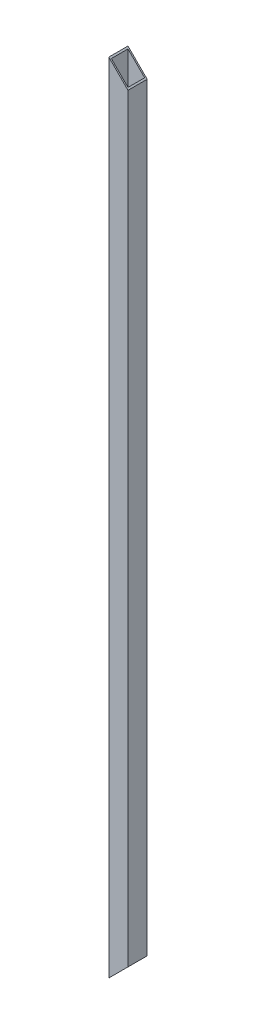
ISO-10303-21;
HEADER;
FILE_DESCRIPTION(('STEP AP214'),'2;1');
FILE_NAME('part.step','',(''),(''),'','','');
FILE_SCHEMA(('AUTOMOTIVE_DESIGN { 1 0 10303 214 1 1 1 1 }'));
ENDSEC;
DATA;
#1=APPLICATION_CONTEXT('core data for automotive mechanical design processes');
#2=APPLICATION_PROTOCOL_DEFINITION('international standard','automotive_design',2000,#1);
#3=PRODUCT_CONTEXT('',#1,'mechanical');
#4=PRODUCT('Part','Part','',(#3));
#5=PRODUCT_RELATED_PRODUCT_CATEGORY('part','',(#4));
#6=PRODUCT_DEFINITION_FORMATION('','',#4);
#7=PRODUCT_DEFINITION_CONTEXT('part definition',#1,'design');
#8=PRODUCT_DEFINITION('design','',#6,#7);
#9=PRODUCT_DEFINITION_SHAPE('','',#8);
#10=(LENGTH_UNIT() NAMED_UNIT(*) SI_UNIT(.MILLI.,.METRE.));
#11=(NAMED_UNIT(*) PLANE_ANGLE_UNIT() SI_UNIT($,.RADIAN.));
#12=(NAMED_UNIT(*) SI_UNIT($,.STERADIAN.) SOLID_ANGLE_UNIT());
#13=UNCERTAINTY_MEASURE_WITH_UNIT(LENGTH_MEASURE(1.E-05),#10,'distance_accuracy_value','');
#14=(GEOMETRIC_REPRESENTATION_CONTEXT(3) GLOBAL_UNCERTAINTY_ASSIGNED_CONTEXT((#13)) GLOBAL_UNIT_ASSIGNED_CONTEXT((#10,
#11,#12)) REPRESENTATION_CONTEXT('',''));
#15=CARTESIAN_POINT('',(0.,0.,0.));
#16=DIRECTION('',(0.,0.,1.));
#17=DIRECTION('',(1.,0.,0.));
#18=AXIS2_PLACEMENT_3D('',#15,#16,#17);
#19=CARTESIAN_POINT('',(0.,0.,16.5));
#20=DIRECTION('',(0.,0.,1.));
#21=DIRECTION('',(1.,0.,0.));
#22=AXIS2_PLACEMENT_3D('',#19,#20,#21);
#23=PLANE('',#22);
#24=DIRECTION('',(0.,-1.,0.));
#25=VECTOR('',#24,1.);
#26=CARTESIAN_POINT('',(-16.5,2.49999999999889,16.5));
#27=LINE('',#26,#25);
#28=CARTESIAN_POINT('',(-16.5,1577.5,16.5));
#29=VERTEX_POINT('',#28);
#30=CARTESIAN_POINT('',(-16.5,2.49999999999889,16.5));
#31=VERTEX_POINT('',#30);
#32=EDGE_CURVE('E128',#29,#31,#27,.T.);
#33=ORIENTED_EDGE('',*,*,#32,.F.);
#34=DIRECTION('',(-0.707106781186547,0.707106781186548,0.));
#35=VECTOR('',#34,1.);
#36=CARTESIAN_POINT('',(19.,1542.,16.5));
#37=LINE('',#36,#35);
#38=CARTESIAN_POINT('',(16.5,1544.5,16.5));
#39=VERTEX_POINT('',#38);
#40=EDGE_CURVE('E151',#39,#29,#37,.T.);
#41=ORIENTED_EDGE('',*,*,#40,.F.);
#42=DIRECTION('',(0.,1.,0.));
#43=VECTOR('',#42,1.);
#44=CARTESIAN_POINT('',(16.5,1544.5,16.5));
#45=LINE('',#44,#43);
#46=CARTESIAN_POINT('',(16.4999999999999,35.4999999999999,16.5));
#47=VERTEX_POINT('',#46);
#48=EDGE_CURVE('E139',#47,#39,#45,.T.);
#49=ORIENTED_EDGE('',*,*,#48,.F.);
#50=DIRECTION('',(0.707106781186548,0.707106781186548,0.));
#51=VECTOR('',#50,1.);
#52=CARTESIAN_POINT('',(-19.,0.,16.5));
#53=LINE('',#52,#51);
#54=EDGE_CURVE('E54',#31,#47,#53,.T.);
#55=ORIENTED_EDGE('',*,*,#54,.F.);
#56=EDGE_LOOP('',(#33,#41,#49,#55));
#57=FACE_BOUND('',#56,.T.);
#58=ADVANCED_FACE('F37',(#57),#23,.F.);
#59=CARTESIAN_POINT('',(19.,38.,16.5));
#60=DIRECTION('',(1.,0.,0.));
#61=DIRECTION('',(0.,0.,-1.));
#62=AXIS2_PLACEMENT_3D('',#59,#60,#61);
#63=PLANE('',#62);
#64=DIRECTION('',(0.,1.,0.));
#65=VECTOR('',#64,1.);
#66=CARTESIAN_POINT('',(19.,38.,19.));
#67=LINE('',#66,#65);
#68=CARTESIAN_POINT('',(19.,38.,19.));
#69=VERTEX_POINT('',#68);
#70=CARTESIAN_POINT('',(19.,1542.,19.));
#71=VERTEX_POINT('',#70);
#72=EDGE_CURVE('E106',#69,#71,#67,.T.);
#73=ORIENTED_EDGE('',*,*,#72,.F.);
#74=DIRECTION('',(0.,0.,1.));
#75=VECTOR('',#74,1.);
#76=CARTESIAN_POINT('',(19.,38.,16.5));
#77=LINE('',#76,#75);
#78=CARTESIAN_POINT('',(19.,38.0000000000005,-19.));
#79=VERTEX_POINT('',#78);
#80=EDGE_CURVE('E11',#79,#69,#77,.T.);
#81=ORIENTED_EDGE('',*,*,#80,.F.);
#82=DIRECTION('',(0.,-1.,0.));
#83=VECTOR('',#82,1.);
#84=CARTESIAN_POINT('',(19.,38.0000000000005,-19.));
#85=LINE('',#84,#83);
#86=CARTESIAN_POINT('',(19.,1542.,-19.));
#87=VERTEX_POINT('',#86);
#88=EDGE_CURVE('E104',#87,#79,#85,.T.);
#89=ORIENTED_EDGE('',*,*,#88,.F.);
#90=DIRECTION('',(0.,0.,1.));
#91=VECTOR('',#90,1.);
#92=CARTESIAN_POINT('',(19.,1542.,16.5));
#93=LINE('',#92,#91);
#94=EDGE_CURVE('E41',#87,#71,#93,.T.);
#95=ORIENTED_EDGE('',*,*,#94,.T.);
#96=EDGE_LOOP('',(#73,#81,#89,#95));
#97=FACE_BOUND('',#96,.T.);
#98=ADVANCED_FACE('F39',(#97),#63,.T.);
#99=CARTESIAN_POINT('',(-19.,0.,16.5));
#100=DIRECTION('',(0.707106781186548,-0.707106781186548,0.));
#101=DIRECTION('',(0.707106781186548,0.707106781186548,0.));
#102=AXIS2_PLACEMENT_3D('',#99,#100,#101);
#103=PLANE('',#102);
#104=DIRECTION('',(0.,0.,1.));
#105=VECTOR('',#104,1.);
#106=CARTESIAN_POINT('',(16.5,35.5000000000001,-16.5000000000002));
#107=LINE('',#106,#105);
#108=CARTESIAN_POINT('',(16.5,35.5000000000001,-16.5000000000002));
#109=VERTEX_POINT('',#108);
#110=EDGE_CURVE('E148',#109,#47,#107,.T.);
#111=ORIENTED_EDGE('',*,*,#110,.F.);
#112=DIRECTION('',(-0.707106781186543,-0.707106781186552,0.));
#113=VECTOR('',#112,1.);
#114=CARTESIAN_POINT('',(-19.,0.,-16.5));
#115=LINE('',#114,#113);
#116=CARTESIAN_POINT('',(-16.5,2.49999999999889,-16.5));
#117=VERTEX_POINT('',#116);
#118=EDGE_CURVE('E123',#109,#117,#115,.T.);
#119=ORIENTED_EDGE('',*,*,#118,.T.);
#120=DIRECTION('',(0.,0.,1.));
#121=VECTOR('',#120,1.);
#122=CARTESIAN_POINT('',(-16.5,2.49999999999889,-16.5));
#123=LINE('',#122,#121);
#124=EDGE_CURVE('E134',#117,#31,#123,.T.);
#125=ORIENTED_EDGE('',*,*,#124,.T.);
#126=ORIENTED_EDGE('',*,*,#54,.T.);
#127=EDGE_LOOP('',(#111,#119,#125,#126));
#128=FACE_BOUND('',#127,.T.);
#129=DIRECTION('',(0.707106781186548,0.707106781186548,0.));
#130=VECTOR('',#129,1.);
#131=CARTESIAN_POINT('',(-19.,0.,19.));
#132=LINE('',#131,#130);
#133=CARTESIAN_POINT('',(-19.,0.,19.));
#134=VERTEX_POINT('',#133);
#135=EDGE_CURVE('E154',#134,#69,#132,.T.);
#136=ORIENTED_EDGE('',*,*,#135,.F.);
#137=DIRECTION('',(0.,0.,1.));
#138=VECTOR('',#137,1.);
#139=CARTESIAN_POINT('',(-19.,0.,16.5));
#140=LINE('',#139,#138);
#141=CARTESIAN_POINT('',(-19.,0.,-19.));
#142=VERTEX_POINT('',#141);
#143=EDGE_CURVE('E46',#142,#134,#140,.T.);
#144=ORIENTED_EDGE('',*,*,#143,.F.);
#145=DIRECTION('',(-0.707106781186543,-0.707106781186552,0.));
#146=VECTOR('',#145,1.);
#147=CARTESIAN_POINT('',(-19.,0.,-19.));
#148=LINE('',#147,#146);
#149=EDGE_CURVE('E109',#79,#142,#148,.T.);
#150=ORIENTED_EDGE('',*,*,#149,.F.);
#151=ORIENTED_EDGE('',*,*,#80,.T.);
#152=EDGE_LOOP('',(#136,#144,#150,#151));
#153=FACE_BOUND('',#152,.T.);
#154=ADVANCED_FACE('F110',(#128,#153),#103,.T.);
#155=CARTESIAN_POINT('',(-19.,1580.,16.5));
#156=DIRECTION('',(-1.,0.,0.));
#157=DIRECTION('',(0.,0.,1.));
#158=AXIS2_PLACEMENT_3D('',#155,#156,#157);
#159=PLANE('',#158);
#160=DIRECTION('',(0.,-1.,0.));
#161=VECTOR('',#160,1.);
#162=CARTESIAN_POINT('',(-19.,1580.,19.));
#163=LINE('',#162,#161);
#164=CARTESIAN_POINT('',(-19.,1580.,19.));
#165=VERTEX_POINT('',#164);
#166=EDGE_CURVE('E160',#165,#134,#163,.T.);
#167=ORIENTED_EDGE('',*,*,#166,.F.);
#168=DIRECTION('',(0.,0.,1.));
#169=VECTOR('',#168,1.);
#170=CARTESIAN_POINT('',(-19.,1580.,16.5));
#171=LINE('',#170,#169);
#172=CARTESIAN_POINT('',(-19.,1580.,-19.));
#173=VERTEX_POINT('',#172);
#174=EDGE_CURVE('E164',#173,#165,#171,.T.);
#175=ORIENTED_EDGE('',*,*,#174,.F.);
#176=DIRECTION('',(0.,1.,0.));
#177=VECTOR('',#176,1.);
#178=CARTESIAN_POINT('',(-19.,1580.,-19.));
#179=LINE('',#178,#177);
#180=EDGE_CURVE('E114',#142,#173,#179,.T.);
#181=ORIENTED_EDGE('',*,*,#180,.F.);
#182=ORIENTED_EDGE('',*,*,#143,.T.);
#183=EDGE_LOOP('',(#167,#175,#181,#182));
#184=FACE_BOUND('',#183,.T.);
#185=ADVANCED_FACE('F173',(#184),#159,.T.);
#186=CARTESIAN_POINT('',(19.,1542.,16.5));
#187=DIRECTION('',(0.707106781186548,0.707106781186547,0.));
#188=DIRECTION('',(-0.707106781186547,0.707106781186548,0.));
#189=AXIS2_PLACEMENT_3D('',#186,#187,#188);
#190=PLANE('',#189);
#191=ORIENTED_EDGE('',*,*,#94,.F.);
#192=DIRECTION('',(0.707106781186547,-0.707106781186548,0.));
#193=VECTOR('',#192,1.);
#194=CARTESIAN_POINT('',(19.,1542.,-19.));
#195=LINE('',#194,#193);
#196=EDGE_CURVE('E119',#173,#87,#195,.T.);
#197=ORIENTED_EDGE('',*,*,#196,.F.);
#198=ORIENTED_EDGE('',*,*,#174,.T.);
#199=DIRECTION('',(-0.707106781186547,0.707106781186548,0.));
#200=VECTOR('',#199,1.);
#201=CARTESIAN_POINT('',(19.,1542.,19.));
#202=LINE('',#201,#200);
#203=EDGE_CURVE('E157',#71,#165,#202,.T.);
#204=ORIENTED_EDGE('',*,*,#203,.F.);
#205=EDGE_LOOP('',(#191,#197,#198,#204));
#206=FACE_BOUND('',#205,.T.);
#207=DIRECTION('',(0.707106781186547,-0.707106781186548,0.));
#208=VECTOR('',#207,1.);
#209=CARTESIAN_POINT('',(19.,1542.,-16.5));
#210=LINE('',#209,#208);
#211=CARTESIAN_POINT('',(-16.5000000000002,1577.5,-16.5));
#212=VERTEX_POINT('',#211);
#213=CARTESIAN_POINT('',(16.5,1544.5,-16.5000000000002));
#214=VERTEX_POINT('',#213);
#215=EDGE_CURVE('E120',#212,#214,#210,.T.);
#216=ORIENTED_EDGE('',*,*,#215,.T.);
#217=DIRECTION('',(0.,0.,1.));
#218=VECTOR('',#217,1.);
#219=CARTESIAN_POINT('',(16.5,1544.5,-16.5000000000002));
#220=LINE('',#219,#218);
#221=EDGE_CURVE('E143',#214,#39,#220,.T.);
#222=ORIENTED_EDGE('',*,*,#221,.T.);
#223=ORIENTED_EDGE('',*,*,#40,.T.);
#224=DIRECTION('',(0.,0.,1.));
#225=VECTOR('',#224,1.);
#226=CARTESIAN_POINT('',(-16.5,1577.5,-16.5));
#227=LINE('',#226,#225);
#228=EDGE_CURVE('E137',#212,#29,#227,.T.);
#229=ORIENTED_EDGE('',*,*,#228,.F.);
#230=EDGE_LOOP('',(#216,#222,#223,#229));
#231=FACE_BOUND('',#230,.T.);
#232=ADVANCED_FACE('F168',(#206,#231),#190,.T.);
#233=CARTESIAN_POINT('',(0.,0.,19.));
#234=DIRECTION('',(0.,0.,1.));
#235=DIRECTION('',(1.,0.,0.));
#236=AXIS2_PLACEMENT_3D('',#233,#234,#235);
#237=PLANE('',#236);
#238=ORIENTED_EDGE('',*,*,#72,.T.);
#239=ORIENTED_EDGE('',*,*,#203,.T.);
#240=ORIENTED_EDGE('',*,*,#166,.T.);
#241=ORIENTED_EDGE('',*,*,#135,.T.);
#242=EDGE_LOOP('',(#238,#239,#240,#241));
#243=FACE_BOUND('',#242,.T.);
#244=ADVANCED_FACE('F171',(#243),#237,.T.);
#245=CARTESIAN_POINT('',(16.5,1544.5,-16.5000000000002));
#246=DIRECTION('',(1.,0.,0.));
#247=DIRECTION('',(0.,1.,0.));
#248=AXIS2_PLACEMENT_3D('',#245,#246,#247);
#249=PLANE('',#248);
#250=ORIENTED_EDGE('',*,*,#48,.T.);
#251=ORIENTED_EDGE('',*,*,#221,.F.);
#252=DIRECTION('',(0.,1.,0.));
#253=VECTOR('',#252,1.);
#254=CARTESIAN_POINT('',(16.5,1544.5,-16.5000000000002));
#255=LINE('',#254,#253);
#256=EDGE_CURVE('E140',#109,#214,#255,.T.);
#257=ORIENTED_EDGE('',*,*,#256,.F.);
#258=ORIENTED_EDGE('',*,*,#110,.T.);
#259=EDGE_LOOP('',(#250,#251,#257,#258));
#260=FACE_BOUND('',#259,.T.);
#261=ADVANCED_FACE('F190',(#260),#249,.F.);
#262=CARTESIAN_POINT('',(-16.5,2.49999999999889,-16.5));
#263=DIRECTION('',(-1.,0.,0.));
#264=DIRECTION('',(0.,-1.,0.));
#265=AXIS2_PLACEMENT_3D('',#262,#263,#264);
#266=PLANE('',#265);
#267=ORIENTED_EDGE('',*,*,#32,.T.);
#268=ORIENTED_EDGE('',*,*,#124,.F.);
#269=DIRECTION('',(0.,-1.,0.));
#270=VECTOR('',#269,1.);
#271=CARTESIAN_POINT('',(-16.5,2.49999999999889,-16.5));
#272=LINE('',#271,#270);
#273=EDGE_CURVE('E131',#212,#117,#272,.T.);
#274=ORIENTED_EDGE('',*,*,#273,.F.);
#275=ORIENTED_EDGE('',*,*,#228,.T.);
#276=EDGE_LOOP('',(#267,#268,#274,#275));
#277=FACE_BOUND('',#276,.T.);
#278=ADVANCED_FACE('F196',(#277),#266,.F.);
#279=CARTESIAN_POINT('',(0.,0.,-16.5));
#280=DIRECTION('',(0.,0.,1.));
#281=DIRECTION('',(1.,0.,0.));
#282=AXIS2_PLACEMENT_3D('',#279,#280,#281);
#283=PLANE('',#282);
#284=ORIENTED_EDGE('',*,*,#256,.T.);
#285=ORIENTED_EDGE('',*,*,#215,.F.);
#286=ORIENTED_EDGE('',*,*,#273,.T.);
#287=ORIENTED_EDGE('',*,*,#118,.F.);
#288=EDGE_LOOP('',(#284,#285,#286,#287));
#289=FACE_BOUND('',#288,.T.);
#290=ADVANCED_FACE('F201',(#289),#283,.T.);
#291=CARTESIAN_POINT('',(0.,0.,-19.));
#292=DIRECTION('',(0.,0.,1.));
#293=DIRECTION('',(1.,0.,0.));
#294=AXIS2_PLACEMENT_3D('',#291,#292,#293);
#295=PLANE('',#294);
#296=ORIENTED_EDGE('',*,*,#88,.T.);
#297=ORIENTED_EDGE('',*,*,#149,.T.);
#298=ORIENTED_EDGE('',*,*,#180,.T.);
#299=ORIENTED_EDGE('',*,*,#196,.T.);
#300=EDGE_LOOP('',(#296,#297,#298,#299));
#301=FACE_BOUND('',#300,.T.);
#302=ADVANCED_FACE('F117',(#301),#295,.F.);
#303=CLOSED_SHELL('',(#58,#98,#154,#185,#232,#244,#261,#278,#290,#302));
#304=MANIFOLD_SOLID_BREP('B2',#303);
#305=ADVANCED_BREP_SHAPE_REPRESENTATION('',(#18,#304),#14);
#306=SHAPE_DEFINITION_REPRESENTATION(#9,#305);
ENDSEC;
END-ISO-10303-21;
